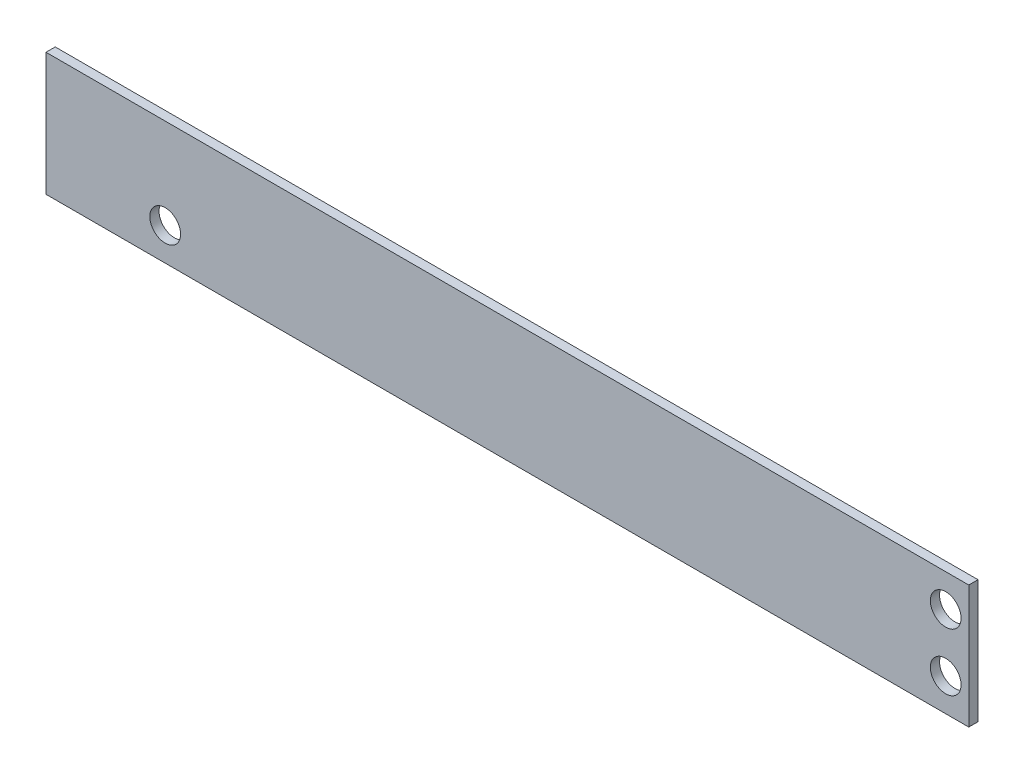
ISO-10303-21;
HEADER;
FILE_DESCRIPTION(('STEP AP214'),'2;1');
FILE_NAME('part.step','',(''),(''),'','','');
FILE_SCHEMA(('AUTOMOTIVE_DESIGN { 1 0 10303 214 1 1 1 1 }'));
ENDSEC;
DATA;
#1=APPLICATION_CONTEXT('core data for automotive mechanical design processes');
#2=APPLICATION_PROTOCOL_DEFINITION('international standard','automotive_design',2000,#1);
#3=PRODUCT_CONTEXT('',#1,'mechanical');
#4=PRODUCT('Part','Part','',(#3));
#5=PRODUCT_RELATED_PRODUCT_CATEGORY('part','',(#4));
#6=PRODUCT_DEFINITION_FORMATION('','',#4);
#7=PRODUCT_DEFINITION_CONTEXT('part definition',#1,'design');
#8=PRODUCT_DEFINITION('design','',#6,#7);
#9=PRODUCT_DEFINITION_SHAPE('','',#8);
#10=(LENGTH_UNIT() NAMED_UNIT(*) SI_UNIT(.MILLI.,.METRE.));
#11=(NAMED_UNIT(*) PLANE_ANGLE_UNIT() SI_UNIT($,.RADIAN.));
#12=(NAMED_UNIT(*) SI_UNIT($,.STERADIAN.) SOLID_ANGLE_UNIT());
#13=UNCERTAINTY_MEASURE_WITH_UNIT(LENGTH_MEASURE(1.E-05),#10,'distance_accuracy_value','');
#14=(GEOMETRIC_REPRESENTATION_CONTEXT(3) GLOBAL_UNCERTAINTY_ASSIGNED_CONTEXT((#13)) GLOBAL_UNIT_ASSIGNED_CONTEXT((#10,
#11,#12)) REPRESENTATION_CONTEXT('',''));
#15=CARTESIAN_POINT('',(0.,0.,0.));
#16=DIRECTION('',(0.,0.,1.));
#17=DIRECTION('',(1.,0.,0.));
#18=AXIS2_PLACEMENT_3D('',#15,#16,#17);
#19=CARTESIAN_POINT('',(0.,0.,0.6));
#20=DIRECTION('',(0.,0.,1.));
#21=DIRECTION('',(1.,0.,0.));
#22=AXIS2_PLACEMENT_3D('',#19,#20,#21);
#23=PLANE('',#22);
#24=CARTESIAN_POINT('',(31.,1.875,0.6));
#25=DIRECTION('',(0.,0.,1.));
#26=DIRECTION('',(1.,0.,0.));
#27=AXIS2_PLACEMENT_3D('',#24,#25,#26);
#28=CIRCLE('',#27,0.999999999999994);
#29=CARTESIAN_POINT('',(32.,1.875,0.6));
#30=VERTEX_POINT('',#29);
#31=EDGE_CURVE('E117',#30,#30,#28,.T.);
#32=ORIENTED_EDGE('',*,*,#31,.F.);
#33=EDGE_LOOP('',(#32));
#34=FACE_BOUND('',#33,.T.);
#35=DIRECTION('',(0.,-1.,0.));
#36=VECTOR('',#35,1.);
#37=CARTESIAN_POINT('',(-27.5,4.,0.6));
#38=LINE('',#37,#36);
#39=CARTESIAN_POINT('',(-27.5,4.,0.6));
#40=VERTEX_POINT('',#39);
#41=CARTESIAN_POINT('',(-27.5,-4.,0.6));
#42=VERTEX_POINT('',#41);
#43=EDGE_CURVE('E87',#40,#42,#38,.T.);
#44=ORIENTED_EDGE('',*,*,#43,.T.);
#45=DIRECTION('',(1.,0.,0.));
#46=VECTOR('',#45,1.);
#47=CARTESIAN_POINT('',(-27.5,-4.,0.6));
#48=LINE('',#47,#46);
#49=CARTESIAN_POINT('',(32.5,-4.,0.6));
#50=VERTEX_POINT('',#49);
#51=EDGE_CURVE('E82',#42,#50,#48,.T.);
#52=ORIENTED_EDGE('',*,*,#51,.T.);
#53=DIRECTION('',(0.,1.,0.));
#54=VECTOR('',#53,1.);
#55=CARTESIAN_POINT('',(32.5,4.,0.6));
#56=LINE('',#55,#54);
#57=CARTESIAN_POINT('',(32.5,4.,0.6));
#58=VERTEX_POINT('',#57);
#59=EDGE_CURVE('E85',#50,#58,#56,.T.);
#60=ORIENTED_EDGE('',*,*,#59,.T.);
#61=DIRECTION('',(-1.,0.,0.));
#62=VECTOR('',#61,1.);
#63=CARTESIAN_POINT('',(-27.5,4.,0.6));
#64=LINE('',#63,#62);
#65=EDGE_CURVE('E52',#58,#40,#64,.T.);
#66=ORIENTED_EDGE('',*,*,#65,.T.);
#67=EDGE_LOOP('',(#44,#52,#60,#66));
#68=FACE_BOUND('',#67,.T.);
#69=CARTESIAN_POINT('',(-19.75,-1.875,0.6));
#70=DIRECTION('',(0.,0.,1.));
#71=DIRECTION('',(1.,0.,0.));
#72=AXIS2_PLACEMENT_3D('',#69,#70,#71);
#73=CIRCLE('',#72,1.);
#74=CARTESIAN_POINT('',(-18.75,-1.875,0.6));
#75=VERTEX_POINT('',#74);
#76=EDGE_CURVE('E102',#75,#75,#73,.T.);
#77=ORIENTED_EDGE('',*,*,#76,.F.);
#78=EDGE_LOOP('',(#77));
#79=FACE_BOUND('',#78,.T.);
#80=CARTESIAN_POINT('',(31.,-1.875,0.6));
#81=DIRECTION('',(0.,0.,1.));
#82=DIRECTION('',(1.,0.,0.));
#83=AXIS2_PLACEMENT_3D('',#80,#81,#82);
#84=CIRCLE('',#83,0.999999999999995);
#85=CARTESIAN_POINT('',(32.,-1.875,0.6));
#86=VERTEX_POINT('',#85);
#87=EDGE_CURVE('E123',#86,#86,#84,.T.);
#88=ORIENTED_EDGE('',*,*,#87,.F.);
#89=EDGE_LOOP('',(#88));
#90=FACE_BOUND('',#89,.T.);
#91=ADVANCED_FACE('F35',(#34,#68,#79,#90),#23,.T.);
#92=CARTESIAN_POINT('',(0.,0.,0.));
#93=DIRECTION('',(0.,0.,1.));
#94=DIRECTION('',(1.,0.,0.));
#95=AXIS2_PLACEMENT_3D('',#92,#93,#94);
#96=PLANE('',#95);
#97=CARTESIAN_POINT('',(31.,1.875,0.));
#98=DIRECTION('',(0.,0.,1.));
#99=DIRECTION('',(1.,0.,0.));
#100=AXIS2_PLACEMENT_3D('',#97,#98,#99);
#101=CIRCLE('',#100,0.999999999999994);
#102=CARTESIAN_POINT('',(32.,1.875,0.));
#103=VERTEX_POINT('',#102);
#104=EDGE_CURVE('E120',#103,#103,#101,.T.);
#105=ORIENTED_EDGE('',*,*,#104,.T.);
#106=EDGE_LOOP('',(#105));
#107=FACE_BOUND('',#106,.T.);
#108=DIRECTION('',(0.,-1.,0.));
#109=VECTOR('',#108,1.);
#110=CARTESIAN_POINT('',(-27.5,4.,0.));
#111=LINE('',#110,#109);
#112=CARTESIAN_POINT('',(-27.5,4.,0.));
#113=VERTEX_POINT('',#112);
#114=CARTESIAN_POINT('',(-27.5,-4.,0.));
#115=VERTEX_POINT('',#114);
#116=EDGE_CURVE('E99',#113,#115,#111,.T.);
#117=ORIENTED_EDGE('',*,*,#116,.F.);
#118=DIRECTION('',(-1.,0.,0.));
#119=VECTOR('',#118,1.);
#120=CARTESIAN_POINT('',(-27.5,4.,0.));
#121=LINE('',#120,#119);
#122=CARTESIAN_POINT('',(32.5,4.,0.));
#123=VERTEX_POINT('',#122);
#124=EDGE_CURVE('E75',#123,#113,#121,.T.);
#125=ORIENTED_EDGE('',*,*,#124,.F.);
#126=DIRECTION('',(0.,1.,0.));
#127=VECTOR('',#126,1.);
#128=CARTESIAN_POINT('',(32.5,4.,0.));
#129=LINE('',#128,#127);
#130=CARTESIAN_POINT('',(32.5,-4.,0.));
#131=VERTEX_POINT('',#130);
#132=EDGE_CURVE('E69',#131,#123,#129,.T.);
#133=ORIENTED_EDGE('',*,*,#132,.F.);
#134=DIRECTION('',(1.,0.,0.));
#135=VECTOR('',#134,1.);
#136=CARTESIAN_POINT('',(-27.5,-4.,0.));
#137=LINE('',#136,#135);
#138=EDGE_CURVE('E91',#115,#131,#137,.T.);
#139=ORIENTED_EDGE('',*,*,#138,.F.);
#140=EDGE_LOOP('',(#117,#125,#133,#139));
#141=FACE_BOUND('',#140,.T.);
#142=CARTESIAN_POINT('',(-19.75,-1.875,0.));
#143=DIRECTION('',(0.,0.,1.));
#144=DIRECTION('',(1.,0.,0.));
#145=AXIS2_PLACEMENT_3D('',#142,#143,#144);
#146=CIRCLE('',#145,1.);
#147=CARTESIAN_POINT('',(-18.75,-1.875,0.));
#148=VERTEX_POINT('',#147);
#149=EDGE_CURVE('E114',#148,#148,#146,.T.);
#150=ORIENTED_EDGE('',*,*,#149,.T.);
#151=EDGE_LOOP('',(#150));
#152=FACE_BOUND('',#151,.T.);
#153=CARTESIAN_POINT('',(31.,-1.875,0.));
#154=DIRECTION('',(0.,0.,1.));
#155=DIRECTION('',(1.,0.,0.));
#156=AXIS2_PLACEMENT_3D('',#153,#154,#155);
#157=CIRCLE('',#156,0.999999999999995);
#158=CARTESIAN_POINT('',(32.,-1.875,0.));
#159=VERTEX_POINT('',#158);
#160=EDGE_CURVE('E126',#159,#159,#157,.T.);
#161=ORIENTED_EDGE('',*,*,#160,.T.);
#162=EDGE_LOOP('',(#161));
#163=FACE_BOUND('',#162,.T.);
#164=ADVANCED_FACE('F110',(#107,#141,#152,#163),#96,.F.);
#165=CARTESIAN_POINT('',(-27.5,4.,0.6));
#166=DIRECTION('',(1.,0.,0.));
#167=DIRECTION('',(0.,0.,-1.));
#168=AXIS2_PLACEMENT_3D('',#165,#166,#167);
#169=PLANE('',#168);
#170=ORIENTED_EDGE('',*,*,#116,.T.);
#171=DIRECTION('',(0.,0.,-1.));
#172=VECTOR('',#171,1.);
#173=CARTESIAN_POINT('',(-27.5,-4.,0.6));
#174=LINE('',#173,#172);
#175=EDGE_CURVE('E11',#42,#115,#174,.T.);
#176=ORIENTED_EDGE('',*,*,#175,.F.);
#177=ORIENTED_EDGE('',*,*,#43,.F.);
#178=DIRECTION('',(0.,0.,-1.));
#179=VECTOR('',#178,1.);
#180=CARTESIAN_POINT('',(-27.5,4.,0.6));
#181=LINE('',#180,#179);
#182=EDGE_CURVE('E95',#40,#113,#181,.T.);
#183=ORIENTED_EDGE('',*,*,#182,.T.);
#184=EDGE_LOOP('',(#170,#176,#177,#183));
#185=FACE_BOUND('',#184,.T.);
#186=ADVANCED_FACE('F37',(#185),#169,.F.);
#187=CARTESIAN_POINT('',(-27.5,-4.,0.6));
#188=DIRECTION('',(0.,1.,0.));
#189=DIRECTION('',(-1.,0.,0.));
#190=AXIS2_PLACEMENT_3D('',#187,#188,#189);
#191=PLANE('',#190);
#192=ORIENTED_EDGE('',*,*,#138,.T.);
#193=DIRECTION('',(0.,0.,-1.));
#194=VECTOR('',#193,1.);
#195=CARTESIAN_POINT('',(32.5,-4.,0.6));
#196=LINE('',#195,#194);
#197=EDGE_CURVE('E44',#50,#131,#196,.T.);
#198=ORIENTED_EDGE('',*,*,#197,.F.);
#199=ORIENTED_EDGE('',*,*,#51,.F.);
#200=ORIENTED_EDGE('',*,*,#175,.T.);
#201=EDGE_LOOP('',(#192,#198,#199,#200));
#202=FACE_BOUND('',#201,.T.);
#203=ADVANCED_FACE('F90',(#202),#191,.F.);
#204=CARTESIAN_POINT('',(32.5,4.,0.6));
#205=DIRECTION('',(-1.,0.,0.));
#206=DIRECTION('',(0.,0.,1.));
#207=AXIS2_PLACEMENT_3D('',#204,#205,#206);
#208=PLANE('',#207);
#209=ORIENTED_EDGE('',*,*,#132,.T.);
#210=DIRECTION('',(0.,0.,-1.));
#211=VECTOR('',#210,1.);
#212=CARTESIAN_POINT('',(32.5,4.,0.6));
#213=LINE('',#212,#211);
#214=EDGE_CURVE('E92',#58,#123,#213,.T.);
#215=ORIENTED_EDGE('',*,*,#214,.F.);
#216=ORIENTED_EDGE('',*,*,#59,.F.);
#217=ORIENTED_EDGE('',*,*,#197,.T.);
#218=EDGE_LOOP('',(#209,#215,#216,#217));
#219=FACE_BOUND('',#218,.T.);
#220=ADVANCED_FACE('F93',(#219),#208,.F.);
#221=CARTESIAN_POINT('',(-27.5,4.,0.6));
#222=DIRECTION('',(0.,-1.,0.));
#223=DIRECTION('',(0.,0.,-1.));
#224=AXIS2_PLACEMENT_3D('',#221,#222,#223);
#225=PLANE('',#224);
#226=ORIENTED_EDGE('',*,*,#124,.T.);
#227=ORIENTED_EDGE('',*,*,#182,.F.);
#228=ORIENTED_EDGE('',*,*,#65,.F.);
#229=ORIENTED_EDGE('',*,*,#214,.T.);
#230=EDGE_LOOP('',(#226,#227,#228,#229));
#231=FACE_BOUND('',#230,.T.);
#232=ADVANCED_FACE('F107',(#231),#225,.F.);
#233=CARTESIAN_POINT('',(-19.75,-1.875,0.6));
#234=DIRECTION('',(0.,0.,-1.));
#235=DIRECTION('',(-1.,0.,0.));
#236=AXIS2_PLACEMENT_3D('',#233,#234,#235);
#237=CYLINDRICAL_SURFACE('',#236,1.);
#238=ORIENTED_EDGE('',*,*,#76,.T.);
#239=EDGE_LOOP('',(#238));
#240=FACE_BOUND('',#239,.T.);
#241=ORIENTED_EDGE('',*,*,#149,.F.);
#242=EDGE_LOOP('',(#241));
#243=FACE_BOUND('',#242,.T.);
#244=ADVANCED_FACE('F145',(#240,#243),#237,.F.);
#245=CARTESIAN_POINT('',(31.,1.875,0.6));
#246=DIRECTION('',(0.,0.,-1.));
#247=DIRECTION('',(-1.,0.,0.));
#248=AXIS2_PLACEMENT_3D('',#245,#246,#247);
#249=CYLINDRICAL_SURFACE('',#248,0.999999999999994);
#250=ORIENTED_EDGE('',*,*,#31,.T.);
#251=EDGE_LOOP('',(#250));
#252=FACE_BOUND('',#251,.T.);
#253=ORIENTED_EDGE('',*,*,#104,.F.);
#254=EDGE_LOOP('',(#253));
#255=FACE_BOUND('',#254,.T.);
#256=ADVANCED_FACE('F197',(#252,#255),#249,.F.);
#257=CARTESIAN_POINT('',(31.,-1.875,0.6));
#258=DIRECTION('',(0.,0.,-1.));
#259=DIRECTION('',(-1.,0.,0.));
#260=AXIS2_PLACEMENT_3D('',#257,#258,#259);
#261=CYLINDRICAL_SURFACE('',#260,0.999999999999995);
#262=ORIENTED_EDGE('',*,*,#87,.T.);
#263=EDGE_LOOP('',(#262));
#264=FACE_BOUND('',#263,.T.);
#265=ORIENTED_EDGE('',*,*,#160,.F.);
#266=EDGE_LOOP('',(#265));
#267=FACE_BOUND('',#266,.T.);
#268=ADVANCED_FACE('F132',(#264,#267),#261,.F.);
#269=CLOSED_SHELL('',(#91,#164,#186,#203,#220,#232,#244,#256,#268));
#270=MANIFOLD_SOLID_BREP('B2',#269);
#271=ADVANCED_BREP_SHAPE_REPRESENTATION('',(#18,#270),#14);
#272=SHAPE_DEFINITION_REPRESENTATION(#9,#271);
ENDSEC;
END-ISO-10303-21;
